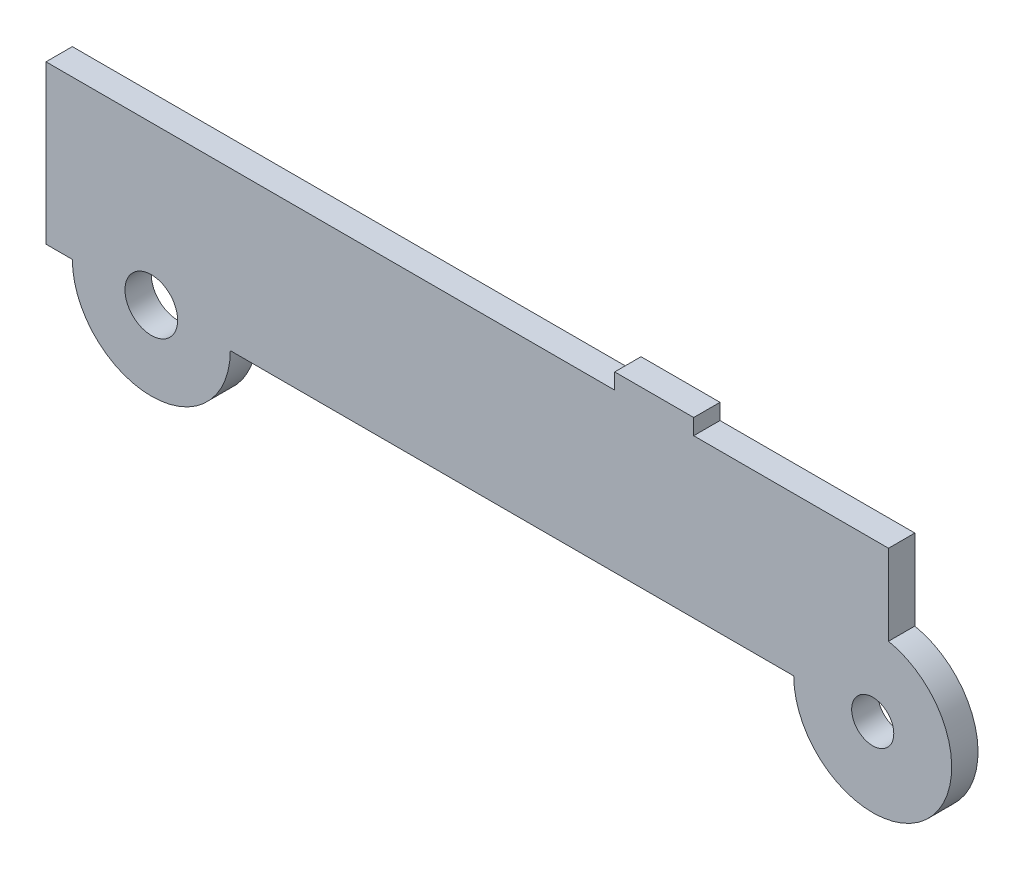
ISO-10303-21;
HEADER;
FILE_DESCRIPTION(('STEP AP214'),'2;1');
FILE_NAME('part.step','',(''),(''),'','','');
FILE_SCHEMA(('AUTOMOTIVE_DESIGN { 1 0 10303 214 1 1 1 1 }'));
ENDSEC;
DATA;
#1=APPLICATION_CONTEXT('core data for automotive mechanical design processes');
#2=APPLICATION_PROTOCOL_DEFINITION('international standard','automotive_design',2000,#1);
#3=PRODUCT_CONTEXT('',#1,'mechanical');
#4=PRODUCT('Part','Part','',(#3));
#5=PRODUCT_RELATED_PRODUCT_CATEGORY('part','',(#4));
#6=PRODUCT_DEFINITION_FORMATION('','',#4);
#7=PRODUCT_DEFINITION_CONTEXT('part definition',#1,'design');
#8=PRODUCT_DEFINITION('design','',#6,#7);
#9=PRODUCT_DEFINITION_SHAPE('','',#8);
#10=(LENGTH_UNIT() NAMED_UNIT(*) SI_UNIT(.MILLI.,.METRE.));
#11=(NAMED_UNIT(*) PLANE_ANGLE_UNIT() SI_UNIT($,.RADIAN.));
#12=(NAMED_UNIT(*) SI_UNIT($,.STERADIAN.) SOLID_ANGLE_UNIT());
#13=UNCERTAINTY_MEASURE_WITH_UNIT(LENGTH_MEASURE(1.E-05),#10,'distance_accuracy_value','');
#14=(GEOMETRIC_REPRESENTATION_CONTEXT(3) GLOBAL_UNCERTAINTY_ASSIGNED_CONTEXT((#13)) GLOBAL_UNIT_ASSIGNED_CONTEXT((#10,
#11,#12)) REPRESENTATION_CONTEXT('',''));
#15=CARTESIAN_POINT('',(0.,0.,0.));
#16=DIRECTION('',(0.,0.,1.));
#17=DIRECTION('',(1.,0.,0.));
#18=AXIS2_PLACEMENT_3D('',#15,#16,#17);
#19=CARTESIAN_POINT('',(-80.,15.,5.));
#20=DIRECTION('',(0.,-1.,0.));
#21=DIRECTION('',(0.,0.,-1.));
#22=AXIS2_PLACEMENT_3D('',#19,#20,#21);
#23=PLANE('',#22);
#24=DIRECTION('',(0.,0.,1.));
#25=VECTOR('',#24,1.);
#26=CARTESIAN_POINT('',(28.,15.,0.));
#27=LINE('',#26,#25);
#28=CARTESIAN_POINT('',(28.,15.,0.));
#29=VERTEX_POINT('',#28);
#30=CARTESIAN_POINT('',(28.,15.,5.));
#31=VERTEX_POINT('',#30);
#32=EDGE_CURVE('E145',#29,#31,#27,.T.);
#33=ORIENTED_EDGE('',*,*,#32,.F.);
#34=DIRECTION('',(-1.,0.,0.));
#35=VECTOR('',#34,1.);
#36=CARTESIAN_POINT('',(-80.,15.,0.));
#37=LINE('',#36,#35);
#38=CARTESIAN_POINT('',(-80.,15.,0.));
#39=VERTEX_POINT('',#38);
#40=EDGE_CURVE('E197',#29,#39,#37,.T.);
#41=ORIENTED_EDGE('',*,*,#40,.T.);
#42=DIRECTION('',(0.,0.,-1.));
#43=VECTOR('',#42,1.);
#44=CARTESIAN_POINT('',(-80.,15.,5.));
#45=LINE('',#44,#43);
#46=CARTESIAN_POINT('',(-80.,15.,5.));
#47=VERTEX_POINT('',#46);
#48=EDGE_CURVE('E47',#47,#39,#45,.T.);
#49=ORIENTED_EDGE('',*,*,#48,.F.);
#50=DIRECTION('',(-1.,0.,0.));
#51=VECTOR('',#50,1.);
#52=CARTESIAN_POINT('',(-80.,15.,5.));
#53=LINE('',#52,#51);
#54=EDGE_CURVE('E54',#31,#47,#53,.T.);
#55=ORIENTED_EDGE('',*,*,#54,.F.);
#56=EDGE_LOOP('',(#33,#41,#49,#55));
#57=FACE_BOUND('',#56,.T.);
#58=ADVANCED_FACE('F39',(#57),#23,.F.);
#59=DIRECTION('',(0.,0.,-1.));
#60=VECTOR('',#59,1.);
#61=CARTESIAN_POINT('',(43.,15.,0.));
#62=LINE('',#61,#60);
#63=CARTESIAN_POINT('',(43.,15.,5.));
#64=VERTEX_POINT('',#63);
#65=CARTESIAN_POINT('',(43.,15.,0.));
#66=VERTEX_POINT('',#65);
#67=EDGE_CURVE('E62',#64,#66,#62,.T.);
#68=ORIENTED_EDGE('',*,*,#67,.F.);
#69=CARTESIAN_POINT('',(80.,15.,5.));
#70=VERTEX_POINT('',#69);
#71=EDGE_CURVE('E187',#70,#64,#53,.T.);
#72=ORIENTED_EDGE('',*,*,#71,.F.);
#73=DIRECTION('',(0.,0.,-1.));
#74=VECTOR('',#73,1.);
#75=CARTESIAN_POINT('',(80.,15.,5.));
#76=LINE('',#75,#74);
#77=CARTESIAN_POINT('',(80.,15.,0.));
#78=VERTEX_POINT('',#77);
#79=EDGE_CURVE('E11',#70,#78,#76,.T.);
#80=ORIENTED_EDGE('',*,*,#79,.T.);
#81=EDGE_CURVE('E198',#78,#66,#37,.T.);
#82=ORIENTED_EDGE('',*,*,#81,.T.);
#83=EDGE_LOOP('',(#68,#72,#80,#82));
#84=FACE_BOUND('',#83,.T.);
#85=ADVANCED_FACE('F238',(#84),#23,.F.);
#86=CARTESIAN_POINT('',(-80.,-15.,5.));
#87=DIRECTION('',(0.,1.,0.));
#88=DIRECTION('',(0.,0.,1.));
#89=AXIS2_PLACEMENT_3D('',#86,#87,#88);
#90=PLANE('',#89);
#91=DIRECTION('',(1.,0.,0.));
#92=VECTOR('',#91,1.);
#93=CARTESIAN_POINT('',(-80.,-15.,0.));
#94=LINE('',#93,#92);
#95=CARTESIAN_POINT('',(-80.,-15.,0.));
#96=VERTEX_POINT('',#95);
#97=CARTESIAN_POINT('',(-75.,-15.,0.));
#98=VERTEX_POINT('',#97);
#99=EDGE_CURVE('E186',#96,#98,#94,.T.);
#100=ORIENTED_EDGE('',*,*,#99,.T.);
#101=DIRECTION('',(0.,0.,1.));
#102=VECTOR('',#101,1.);
#103=CARTESIAN_POINT('',(-75.,-15.,0.));
#104=LINE('',#103,#102);
#105=CARTESIAN_POINT('',(-75.,-15.,5.));
#106=VERTEX_POINT('',#105);
#107=EDGE_CURVE('E180',#98,#106,#104,.T.);
#108=ORIENTED_EDGE('',*,*,#107,.T.);
#109=DIRECTION('',(1.,0.,0.));
#110=VECTOR('',#109,1.);
#111=CARTESIAN_POINT('',(-80.,-15.,5.));
#112=LINE('',#111,#110);
#113=CARTESIAN_POINT('',(-80.,-15.,5.));
#114=VERTEX_POINT('',#113);
#115=EDGE_CURVE('E192',#114,#106,#112,.T.);
#116=ORIENTED_EDGE('',*,*,#115,.F.);
#117=DIRECTION('',(0.,0.,-1.));
#118=VECTOR('',#117,1.);
#119=CARTESIAN_POINT('',(-80.,-15.,5.));
#120=LINE('',#119,#118);
#121=EDGE_CURVE('E195',#114,#96,#120,.T.);
#122=ORIENTED_EDGE('',*,*,#121,.T.);
#123=EDGE_LOOP('',(#100,#108,#116,#122));
#124=FACE_BOUND('',#123,.T.);
#125=ADVANCED_FACE('F220',(#124),#90,.F.);
#126=CARTESIAN_POINT('',(80.,-15.,5.));
#127=DIRECTION('',(-1.,0.,0.));
#128=DIRECTION('',(0.,0.,1.));
#129=AXIS2_PLACEMENT_3D('',#126,#127,#128);
#130=PLANE('',#129);
#131=DIRECTION('',(0.,1.,0.));
#132=VECTOR('',#131,1.);
#133=CARTESIAN_POINT('',(80.,-15.,5.));
#134=LINE('',#133,#132);
#135=CARTESIAN_POINT('',(80.,-0.303061543300946,5.));
#136=VERTEX_POINT('',#135);
#137=EDGE_CURVE('E184',#136,#70,#134,.T.);
#138=ORIENTED_EDGE('',*,*,#137,.F.);
#139=DIRECTION('',(0.,0.,1.));
#140=VECTOR('',#139,1.);
#141=CARTESIAN_POINT('',(80.,-0.303061543300946,0.));
#142=LINE('',#141,#140);
#143=CARTESIAN_POINT('',(80.,-0.303061543300946,0.));
#144=VERTEX_POINT('',#143);
#145=EDGE_CURVE('E170',#136,#144,#142,.F.);
#146=ORIENTED_EDGE('',*,*,#145,.T.);
#147=DIRECTION('',(0.,1.,0.));
#148=VECTOR('',#147,1.);
#149=CARTESIAN_POINT('',(80.,-15.,0.));
#150=LINE('',#149,#148);
#151=EDGE_CURVE('E183',#144,#78,#150,.T.);
#152=ORIENTED_EDGE('',*,*,#151,.T.);
#153=ORIENTED_EDGE('',*,*,#79,.F.);
#154=EDGE_LOOP('',(#138,#146,#152,#153));
#155=FACE_BOUND('',#154,.T.);
#156=ADVANCED_FACE('F41',(#155),#130,.F.);
#157=CARTESIAN_POINT('',(-80.,-15.,5.));
#158=DIRECTION('',(1.,0.,0.));
#159=DIRECTION('',(0.,0.,-1.));
#160=AXIS2_PLACEMENT_3D('',#157,#158,#159);
#161=PLANE('',#160);
#162=DIRECTION('',(0.,-1.,0.));
#163=VECTOR('',#162,1.);
#164=CARTESIAN_POINT('',(-80.,-15.,0.));
#165=LINE('',#164,#163);
#166=EDGE_CURVE('E200',#39,#96,#165,.T.);
#167=ORIENTED_EDGE('',*,*,#166,.T.);
#168=ORIENTED_EDGE('',*,*,#121,.F.);
#169=DIRECTION('',(0.,-1.,0.));
#170=VECTOR('',#169,1.);
#171=CARTESIAN_POINT('',(-80.,-15.,5.));
#172=LINE('',#171,#170);
#173=EDGE_CURVE('E189',#47,#114,#172,.T.);
#174=ORIENTED_EDGE('',*,*,#173,.F.);
#175=ORIENTED_EDGE('',*,*,#48,.T.);
#176=EDGE_LOOP('',(#167,#168,#174,#175));
#177=FACE_BOUND('',#176,.T.);
#178=ADVANCED_FACE('F210',(#177),#161,.F.);
#179=CARTESIAN_POINT('',(-45.,-15.,0.));
#180=VERTEX_POINT('',#179);
#181=CARTESIAN_POINT('',(62.,-15.,0.));
#182=VERTEX_POINT('',#181);
#183=EDGE_CURVE('E202',#180,#182,#94,.T.);
#184=ORIENTED_EDGE('',*,*,#183,.T.);
#185=DIRECTION('',(0.,0.,1.));
#186=VECTOR('',#185,1.);
#187=CARTESIAN_POINT('',(62.,-15.,0.));
#188=LINE('',#187,#186);
#189=CARTESIAN_POINT('',(62.,-15.,5.));
#190=VERTEX_POINT('',#189);
#191=EDGE_CURVE('E166',#182,#190,#188,.T.);
#192=ORIENTED_EDGE('',*,*,#191,.T.);
#193=CARTESIAN_POINT('',(-45.,-15.,5.));
#194=VERTEX_POINT('',#193);
#195=EDGE_CURVE('E191',#194,#190,#112,.T.);
#196=ORIENTED_EDGE('',*,*,#195,.F.);
#197=DIRECTION('',(0.,0.,1.));
#198=VECTOR('',#197,1.);
#199=CARTESIAN_POINT('',(-45.,-15.,0.));
#200=LINE('',#199,#198);
#201=EDGE_CURVE('E176',#194,#180,#200,.F.);
#202=ORIENTED_EDGE('',*,*,#201,.T.);
#203=EDGE_LOOP('',(#184,#192,#196,#202));
#204=FACE_BOUND('',#203,.T.);
#205=ADVANCED_FACE('F229',(#204),#90,.F.);
#206=CARTESIAN_POINT('',(0.,0.,5.));
#207=DIRECTION('',(0.,0.,-1.));
#208=DIRECTION('',(-1.,0.,0.));
#209=AXIS2_PLACEMENT_3D('',#206,#207,#208);
#210=PLANE('',#209);
#211=CARTESIAN_POINT('',(-60.,-15.,5.));
#212=DIRECTION('',(0.,0.,1.));
#213=DIRECTION('',(1.,0.,0.));
#214=AXIS2_PLACEMENT_3D('',#211,#212,#213);
#215=CIRCLE('',#214,5.);
#216=CARTESIAN_POINT('',(-55.,-15.,5.));
#217=VERTEX_POINT('',#216);
#218=EDGE_CURVE('E159',#217,#217,#215,.T.);
#219=ORIENTED_EDGE('',*,*,#218,.F.);
#220=EDGE_LOOP('',(#219));
#221=FACE_BOUND('',#220,.T.);
#222=CARTESIAN_POINT('',(77.,-15.,5.));
#223=DIRECTION('',(0.,0.,1.));
#224=DIRECTION('',(1.,0.,0.));
#225=AXIS2_PLACEMENT_3D('',#222,#223,#224);
#226=CIRCLE('',#225,4.00000000000001);
#227=CARTESIAN_POINT('',(81.,-15.,5.));
#228=VERTEX_POINT('',#227);
#229=EDGE_CURVE('E146',#228,#228,#226,.T.);
#230=ORIENTED_EDGE('',*,*,#229,.F.);
#231=EDGE_LOOP('',(#230));
#232=FACE_BOUND('',#231,.T.);
#233=CARTESIAN_POINT('',(77.,-15.,5.));
#234=DIRECTION('',(0.,0.,1.));
#235=DIRECTION('',(1.,0.,0.));
#236=AXIS2_PLACEMENT_3D('',#233,#234,#235);
#237=CIRCLE('',#236,15.);
#238=EDGE_CURVE('E158',#190,#136,#237,.T.);
#239=ORIENTED_EDGE('',*,*,#238,.T.);
#240=ORIENTED_EDGE('',*,*,#137,.T.);
#241=ORIENTED_EDGE('',*,*,#71,.T.);
#242=DIRECTION('',(0.,-1.,0.));
#243=VECTOR('',#242,1.);
#244=CARTESIAN_POINT('',(43.,18.,5.00000000000001));
#245=LINE('',#244,#243);
#246=CARTESIAN_POINT('',(43.,18.,5.00000000000001));
#247=VERTEX_POINT('',#246);
#248=EDGE_CURVE('E130',#247,#64,#245,.T.);
#249=ORIENTED_EDGE('',*,*,#248,.F.);
#250=DIRECTION('',(1.,0.,0.));
#251=VECTOR('',#250,1.);
#252=CARTESIAN_POINT('',(28.,18.,5.00000000000002));
#253=LINE('',#252,#251);
#254=CARTESIAN_POINT('',(28.,18.,5.00000000000002));
#255=VERTEX_POINT('',#254);
#256=EDGE_CURVE('E122',#255,#247,#253,.T.);
#257=ORIENTED_EDGE('',*,*,#256,.F.);
#258=DIRECTION('',(0.,-1.,0.));
#259=VECTOR('',#258,1.);
#260=CARTESIAN_POINT('',(28.,18.,5.00000000000002));
#261=LINE('',#260,#259);
#262=EDGE_CURVE('E127',#255,#31,#261,.T.);
#263=ORIENTED_EDGE('',*,*,#262,.T.);
#264=ORIENTED_EDGE('',*,*,#54,.T.);
#265=ORIENTED_EDGE('',*,*,#173,.T.);
#266=ORIENTED_EDGE('',*,*,#115,.T.);
#267=CARTESIAN_POINT('',(-60.,-15.,5.));
#268=DIRECTION('',(0.,0.,1.));
#269=DIRECTION('',(1.,0.,0.));
#270=AXIS2_PLACEMENT_3D('',#267,#268,#269);
#271=CIRCLE('',#270,15.);
#272=EDGE_CURVE('E173',#106,#194,#271,.T.);
#273=ORIENTED_EDGE('',*,*,#272,.T.);
#274=ORIENTED_EDGE('',*,*,#195,.T.);
#275=EDGE_LOOP('',(#239,#240,#241,#249,#257,#263,#264,#265,#266,#273,#274));
#276=FACE_BOUND('',#275,.T.);
#277=ADVANCED_FACE('F125',(#221,#232,#276),#210,.F.);
#278=CARTESIAN_POINT('',(0.,0.,0.));
#279=DIRECTION('',(0.,0.,-1.));
#280=DIRECTION('',(-1.,0.,0.));
#281=AXIS2_PLACEMENT_3D('',#278,#279,#280);
#282=PLANE('',#281);
#283=CARTESIAN_POINT('',(-60.,-15.,0.));
#284=DIRECTION('',(0.,0.,1.));
#285=DIRECTION('',(1.,0.,0.));
#286=AXIS2_PLACEMENT_3D('',#283,#284,#285);
#287=CIRCLE('',#286,5.);
#288=CARTESIAN_POINT('',(-55.,-15.,0.));
#289=VERTEX_POINT('',#288);
#290=EDGE_CURVE('E155',#289,#289,#287,.T.);
#291=ORIENTED_EDGE('',*,*,#290,.T.);
#292=EDGE_LOOP('',(#291));
#293=FACE_BOUND('',#292,.T.);
#294=CARTESIAN_POINT('',(77.,-15.,0.));
#295=DIRECTION('',(0.,0.,1.));
#296=DIRECTION('',(1.,0.,0.));
#297=AXIS2_PLACEMENT_3D('',#294,#295,#296);
#298=CIRCLE('',#297,4.00000000000001);
#299=CARTESIAN_POINT('',(81.,-15.,0.));
#300=VERTEX_POINT('',#299);
#301=EDGE_CURVE('E149',#300,#300,#298,.T.);
#302=ORIENTED_EDGE('',*,*,#301,.T.);
#303=EDGE_LOOP('',(#302));
#304=FACE_BOUND('',#303,.T.);
#305=ORIENTED_EDGE('',*,*,#151,.F.);
#306=CARTESIAN_POINT('',(77.,-15.,0.));
#307=DIRECTION('',(0.,0.,1.));
#308=DIRECTION('',(1.,0.,0.));
#309=AXIS2_PLACEMENT_3D('',#306,#307,#308);
#310=CIRCLE('',#309,15.);
#311=EDGE_CURVE('E164',#182,#144,#310,.T.);
#312=ORIENTED_EDGE('',*,*,#311,.F.);
#313=ORIENTED_EDGE('',*,*,#183,.F.);
#314=CARTESIAN_POINT('',(-60.,-15.,0.));
#315=DIRECTION('',(0.,0.,1.));
#316=DIRECTION('',(1.,0.,0.));
#317=AXIS2_PLACEMENT_3D('',#314,#315,#316);
#318=CIRCLE('',#317,15.);
#319=EDGE_CURVE('E174',#98,#180,#318,.T.);
#320=ORIENTED_EDGE('',*,*,#319,.F.);
#321=ORIENTED_EDGE('',*,*,#99,.F.);
#322=ORIENTED_EDGE('',*,*,#166,.F.);
#323=ORIENTED_EDGE('',*,*,#40,.F.);
#324=DIRECTION('',(0.,-1.,0.));
#325=VECTOR('',#324,1.);
#326=CARTESIAN_POINT('',(28.,18.,0.));
#327=LINE('',#326,#325);
#328=CARTESIAN_POINT('',(28.,18.,0.));
#329=VERTEX_POINT('',#328);
#330=EDGE_CURVE('E243',#329,#29,#327,.T.);
#331=ORIENTED_EDGE('',*,*,#330,.F.);
#332=DIRECTION('',(-1.,0.,0.));
#333=VECTOR('',#332,1.);
#334=CARTESIAN_POINT('',(28.,18.,0.));
#335=LINE('',#334,#333);
#336=CARTESIAN_POINT('',(43.,18.,0.));
#337=VERTEX_POINT('',#336);
#338=EDGE_CURVE('E139',#337,#329,#335,.T.);
#339=ORIENTED_EDGE('',*,*,#338,.F.);
#340=DIRECTION('',(0.,-1.,0.));
#341=VECTOR('',#340,1.);
#342=CARTESIAN_POINT('',(43.,18.,0.));
#343=LINE('',#342,#341);
#344=EDGE_CURVE('E151',#337,#66,#343,.T.);
#345=ORIENTED_EDGE('',*,*,#344,.T.);
#346=ORIENTED_EDGE('',*,*,#81,.F.);
#347=EDGE_LOOP('',(#305,#312,#313,#320,#321,#322,#323,#331,#339,#345,#346));
#348=FACE_BOUND('',#347,.T.);
#349=ADVANCED_FACE('F216',(#293,#304,#348),#282,.T.);
#350=CARTESIAN_POINT('',(-60.,-15.,0.));
#351=DIRECTION('',(0.,0.,1.));
#352=DIRECTION('',(1.,0.,0.));
#353=AXIS2_PLACEMENT_3D('',#350,#351,#352);
#354=CYLINDRICAL_SURFACE('',#353,15.);
#355=ORIENTED_EDGE('',*,*,#107,.F.);
#356=ORIENTED_EDGE('',*,*,#319,.T.);
#357=ORIENTED_EDGE('',*,*,#201,.F.);
#358=ORIENTED_EDGE('',*,*,#272,.F.);
#359=EDGE_LOOP('',(#355,#356,#357,#358));
#360=FACE_BOUND('',#359,.T.);
#361=ADVANCED_FACE('F226',(#360),#354,.T.);
#362=CARTESIAN_POINT('',(77.,-15.,0.));
#363=DIRECTION('',(0.,0.,1.));
#364=DIRECTION('',(1.,0.,0.));
#365=AXIS2_PLACEMENT_3D('',#362,#363,#364);
#366=CYLINDRICAL_SURFACE('',#365,15.);
#367=ORIENTED_EDGE('',*,*,#145,.F.);
#368=ORIENTED_EDGE('',*,*,#238,.F.);
#369=ORIENTED_EDGE('',*,*,#191,.F.);
#370=ORIENTED_EDGE('',*,*,#311,.T.);
#371=EDGE_LOOP('',(#367,#368,#369,#370));
#372=FACE_BOUND('',#371,.T.);
#373=ADVANCED_FACE('F232',(#372),#366,.T.);
#374=CARTESIAN_POINT('',(77.,-15.,0.));
#375=DIRECTION('',(0.,0.,1.));
#376=DIRECTION('',(1.,0.,0.));
#377=AXIS2_PLACEMENT_3D('',#374,#375,#376);
#378=CYLINDRICAL_SURFACE('',#377,4.00000000000001);
#379=ORIENTED_EDGE('',*,*,#301,.F.);
#380=EDGE_LOOP('',(#379));
#381=FACE_BOUND('',#380,.T.);
#382=ORIENTED_EDGE('',*,*,#229,.T.);
#383=EDGE_LOOP('',(#382));
#384=FACE_BOUND('',#383,.T.);
#385=ADVANCED_FACE('F277',(#381,#384),#378,.F.);
#386=CARTESIAN_POINT('',(-60.,-15.,0.));
#387=DIRECTION('',(0.,0.,1.));
#388=DIRECTION('',(1.,0.,0.));
#389=AXIS2_PLACEMENT_3D('',#386,#387,#388);
#390=CYLINDRICAL_SURFACE('',#389,5.);
#391=ORIENTED_EDGE('',*,*,#290,.F.);
#392=EDGE_LOOP('',(#391));
#393=FACE_BOUND('',#392,.T.);
#394=ORIENTED_EDGE('',*,*,#218,.T.);
#395=EDGE_LOOP('',(#394));
#396=FACE_BOUND('',#395,.T.);
#397=ADVANCED_FACE('F255',(#393,#396),#390,.F.);
#398=CARTESIAN_POINT('',(28.,18.,0.));
#399=DIRECTION('',(1.,0.,0.));
#400=DIRECTION('',(0.,0.,-1.));
#401=AXIS2_PLACEMENT_3D('',#398,#399,#400);
#402=PLANE('',#401);
#403=ORIENTED_EDGE('',*,*,#32,.T.);
#404=ORIENTED_EDGE('',*,*,#262,.F.);
#405=DIRECTION('',(0.,0.,1.));
#406=VECTOR('',#405,1.);
#407=CARTESIAN_POINT('',(28.,18.,0.));
#408=LINE('',#407,#406);
#409=EDGE_CURVE('E134',#329,#255,#408,.T.);
#410=ORIENTED_EDGE('',*,*,#409,.F.);
#411=ORIENTED_EDGE('',*,*,#330,.T.);
#412=EDGE_LOOP('',(#403,#404,#410,#411));
#413=FACE_BOUND('',#412,.T.);
#414=ADVANCED_FACE('F144',(#413),#402,.F.);
#415=CARTESIAN_POINT('',(43.,18.,0.));
#416=DIRECTION('',(-1.,0.,0.));
#417=DIRECTION('',(0.,0.,1.));
#418=AXIS2_PLACEMENT_3D('',#415,#416,#417);
#419=PLANE('',#418);
#420=ORIENTED_EDGE('',*,*,#67,.T.);
#421=ORIENTED_EDGE('',*,*,#344,.F.);
#422=DIRECTION('',(0.,0.,-1.));
#423=VECTOR('',#422,1.);
#424=CARTESIAN_POINT('',(43.,18.,0.));
#425=LINE('',#424,#423);
#426=EDGE_CURVE('E133',#247,#337,#425,.T.);
#427=ORIENTED_EDGE('',*,*,#426,.F.);
#428=ORIENTED_EDGE('',*,*,#248,.T.);
#429=EDGE_LOOP('',(#420,#421,#427,#428));
#430=FACE_BOUND('',#429,.T.);
#431=ADVANCED_FACE('F241',(#430),#419,.F.);
#432=CARTESIAN_POINT('',(0.,18.,0.));
#433=DIRECTION('',(0.,1.,0.));
#434=DIRECTION('',(0.,0.,1.));
#435=AXIS2_PLACEMENT_3D('',#432,#433,#434);
#436=PLANE('',#435);
#437=ORIENTED_EDGE('',*,*,#409,.T.);
#438=ORIENTED_EDGE('',*,*,#256,.T.);
#439=ORIENTED_EDGE('',*,*,#426,.T.);
#440=ORIENTED_EDGE('',*,*,#338,.T.);
#441=EDGE_LOOP('',(#437,#438,#439,#440));
#442=FACE_BOUND('',#441,.T.);
#443=ADVANCED_FACE('F137',(#442),#436,.T.);
#444=CLOSED_SHELL('',(#58,#85,#125,#156,#178,#205,#277,#349,#361,#373,#385,#397,#414,#431,#443));
#445=MANIFOLD_SOLID_BREP('B2',#444);
#446=ADVANCED_BREP_SHAPE_REPRESENTATION('',(#18,#445),#14);
#447=SHAPE_DEFINITION_REPRESENTATION(#9,#446);
ENDSEC;
END-ISO-10303-21;
